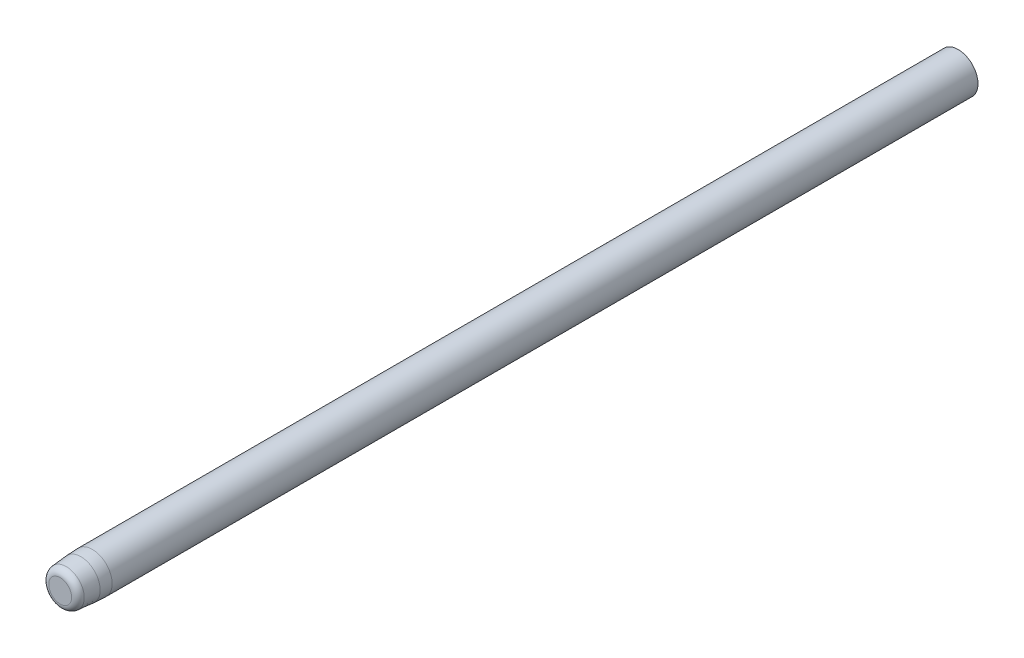
ISO-10303-21;
HEADER;
FILE_DESCRIPTION(('STEP AP214'),'2;1');
FILE_NAME('part.step','',(''),(''),'','','');
FILE_SCHEMA(('AUTOMOTIVE_DESIGN { 1 0 10303 214 1 1 1 1 }'));
ENDSEC;
DATA;
#1=APPLICATION_CONTEXT('core data for automotive mechanical design processes');
#2=APPLICATION_PROTOCOL_DEFINITION('international standard','automotive_design',2000,#1);
#3=PRODUCT_CONTEXT('',#1,'mechanical');
#4=PRODUCT('Part','Part','',(#3));
#5=PRODUCT_RELATED_PRODUCT_CATEGORY('part','',(#4));
#6=PRODUCT_DEFINITION_FORMATION('','',#4);
#7=PRODUCT_DEFINITION_CONTEXT('part definition',#1,'design');
#8=PRODUCT_DEFINITION('design','',#6,#7);
#9=PRODUCT_DEFINITION_SHAPE('','',#8);
#10=(LENGTH_UNIT() NAMED_UNIT(*) SI_UNIT(.MILLI.,.METRE.));
#11=(NAMED_UNIT(*) PLANE_ANGLE_UNIT() SI_UNIT($,.RADIAN.));
#12=(NAMED_UNIT(*) SI_UNIT($,.STERADIAN.) SOLID_ANGLE_UNIT());
#13=UNCERTAINTY_MEASURE_WITH_UNIT(LENGTH_MEASURE(1.E-05),#10,'distance_accuracy_value','');
#14=(GEOMETRIC_REPRESENTATION_CONTEXT(3) GLOBAL_UNCERTAINTY_ASSIGNED_CONTEXT((#13)) GLOBAL_UNIT_ASSIGNED_CONTEXT((#10,
#11,#12)) REPRESENTATION_CONTEXT('',''));
#15=CARTESIAN_POINT('',(0.,0.,0.));
#16=DIRECTION('',(0.,0.,1.));
#17=DIRECTION('',(1.,0.,0.));
#18=AXIS2_PLACEMENT_3D('',#15,#16,#17);
#19=CARTESIAN_POINT('',(0.,0.,86.36));
#20=DIRECTION('',(0.,0.,-1.));
#21=DIRECTION('',(-1.,0.,0.));
#22=AXIS2_PLACEMENT_3D('',#19,#20,#21);
#23=CYLINDRICAL_SURFACE('',#22,1.905);
#24=CARTESIAN_POINT('',(0.,0.,83.2655060250614));
#25=DIRECTION('',(0.,0.,1.));
#26=DIRECTION('',(1.,0.,0.));
#27=AXIS2_PLACEMENT_3D('',#24,#25,#26);
#28=CIRCLE('',#27,1.905);
#29=CARTESIAN_POINT('',(1.905,0.,83.2655060250614));
#30=VERTEX_POINT('',#29);
#31=EDGE_CURVE('E49',#30,#30,#28,.F.);
#32=ORIENTED_EDGE('',*,*,#31,.T.);
#33=EDGE_LOOP('',(#32));
#34=FACE_BOUND('',#33,.T.);
#35=CARTESIAN_POINT('',(0.,0.,0.));
#36=DIRECTION('',(0.,0.,1.));
#37=DIRECTION('',(1.,0.,0.));
#38=AXIS2_PLACEMENT_3D('',#35,#36,#37);
#39=CIRCLE('',#38,1.905);
#40=CARTESIAN_POINT('',(1.905,0.,0.));
#41=VERTEX_POINT('',#40);
#42=EDGE_CURVE('E54',#41,#41,#39,.T.);
#43=ORIENTED_EDGE('',*,*,#42,.T.);
#44=EDGE_LOOP('',(#43));
#45=FACE_BOUND('',#44,.T.);
#46=ADVANCED_FACE('F34',(#34,#45),#23,.T.);
#47=CARTESIAN_POINT('',(0.,0.,86.36));
#48=DIRECTION('',(0.,0.,1.));
#49=DIRECTION('',(1.,0.,0.));
#50=AXIS2_PLACEMENT_3D('',#47,#48,#49);
#51=PLANE('',#50);
#52=CARTESIAN_POINT('',(0.,0.,86.36));
#53=DIRECTION('',(0.,0.,1.));
#54=DIRECTION('',(1.,0.,0.));
#55=AXIS2_PLACEMENT_3D('',#52,#53,#54);
#56=CIRCLE('',#55,1.10090849914305);
#57=CARTESIAN_POINT('',(1.10090849914305,0.,86.36));
#58=VERTEX_POINT('',#57);
#59=EDGE_CURVE('E41',#58,#58,#56,.T.);
#60=ORIENTED_EDGE('',*,*,#59,.T.);
#61=EDGE_LOOP('',(#60));
#62=FACE_BOUND('',#61,.T.);
#63=ADVANCED_FACE('F62',(#62),#51,.T.);
#64=CARTESIAN_POINT('',(0.,0.,0.));
#65=DIRECTION('',(0.,0.,1.));
#66=DIRECTION('',(1.,0.,0.));
#67=AXIS2_PLACEMENT_3D('',#64,#65,#66);
#68=PLANE('',#67);
#69=ORIENTED_EDGE('',*,*,#42,.F.);
#70=EDGE_LOOP('',(#69));
#71=FACE_BOUND('',#70,.T.);
#72=ADVANCED_FACE('F59',(#71),#68,.F.);
#73=CARTESIAN_POINT('',(0.,0.,86.36));
#74=DIRECTION('',(0.,0.,-1.));
#75=DIRECTION('',(-1.,0.,0.));
#76=AXIS2_PLACEMENT_3D('',#73,#74,#75);
#77=CONICAL_SURFACE('',#76,1.68277879464411,0.0872664625997136);
#78=CARTESIAN_POINT('',(0.,0.,85.7803438966448));
#79=DIRECTION('',(0.,0.,1.));
#80=DIRECTION('',(1.,0.,0.));
#81=AXIS2_PLACEMENT_3D('',#78,#79,#80);
#82=CIRCLE('',#81,1.73349213243131);
#83=CARTESIAN_POINT('',(1.73349213243131,0.,85.7803438966448));
#84=VERTEX_POINT('',#83);
#85=EDGE_CURVE('E10',#84,#84,#82,.F.);
#86=ORIENTED_EDGE('',*,*,#85,.T.);
#87=EDGE_LOOP('',(#86));
#88=FACE_BOUND('',#87,.T.);
#89=CARTESIAN_POINT('',(0.,0.,84.3723839579566));
#90=DIRECTION('',(0.,0.,-1.));
#91=DIRECTION('',(-1.,0.,0.));
#92=AXIS2_PLACEMENT_3D('',#89,#90,#91);
#93=CIRCLE('',#92,1.85667266576517);
#94=CARTESIAN_POINT('',(-1.85667266576517,0.,84.3723839579566));
#95=VERTEX_POINT('',#94);
#96=EDGE_CURVE('E45',#95,#95,#93,.F.);
#97=ORIENTED_EDGE('',*,*,#96,.T.);
#98=EDGE_LOOP('',(#97));
#99=FACE_BOUND('',#98,.T.);
#100=ADVANCED_FACE('F61',(#88,#99),#77,.T.);
#101=CARTESIAN_POINT('',(0.,0.,83.2655060250614));
#102=DIRECTION('',(0.,0.,1.));
#103=DIRECTION('',(1.,0.,0.));
#104=AXIS2_PLACEMENT_3D('',#101,#102,#103);
#105=DEGENERATE_TOROIDAL_SURFACE('',#104,10.795,12.7,.F.);
#106=ORIENTED_EDGE('',*,*,#96,.F.);
#107=EDGE_LOOP('',(#106));
#108=FACE_BOUND('',#107,.T.);
#109=ORIENTED_EDGE('',*,*,#31,.F.);
#110=EDGE_LOOP('',(#109));
#111=FACE_BOUND('',#110,.T.);
#112=ADVANCED_FACE('F68',(#108,#111),#105,.F.);
#113=CARTESIAN_POINT('',(0.,0.,85.725));
#114=DIRECTION('',(0.,0.,1.));
#115=DIRECTION('',(1.,0.,0.));
#116=AXIS2_PLACEMENT_3D('',#113,#114,#115);
#117=TOROIDAL_SURFACE('',#116,1.10090849914305,0.635);
#118=ORIENTED_EDGE('',*,*,#85,.F.);
#119=EDGE_LOOP('',(#118));
#120=FACE_BOUND('',#119,.T.);
#121=ORIENTED_EDGE('',*,*,#59,.F.);
#122=EDGE_LOOP('',(#121));
#123=FACE_BOUND('',#122,.T.);
#124=ADVANCED_FACE('F36',(#120,#123),#117,.T.);
#125=CLOSED_SHELL('',(#46,#63,#72,#100,#112,#124));
#126=MANIFOLD_SOLID_BREP('B2',#125);
#127=ADVANCED_BREP_SHAPE_REPRESENTATION('',(#18,#126),#14);
#128=SHAPE_DEFINITION_REPRESENTATION(#9,#127);
ENDSEC;
END-ISO-10303-21;
